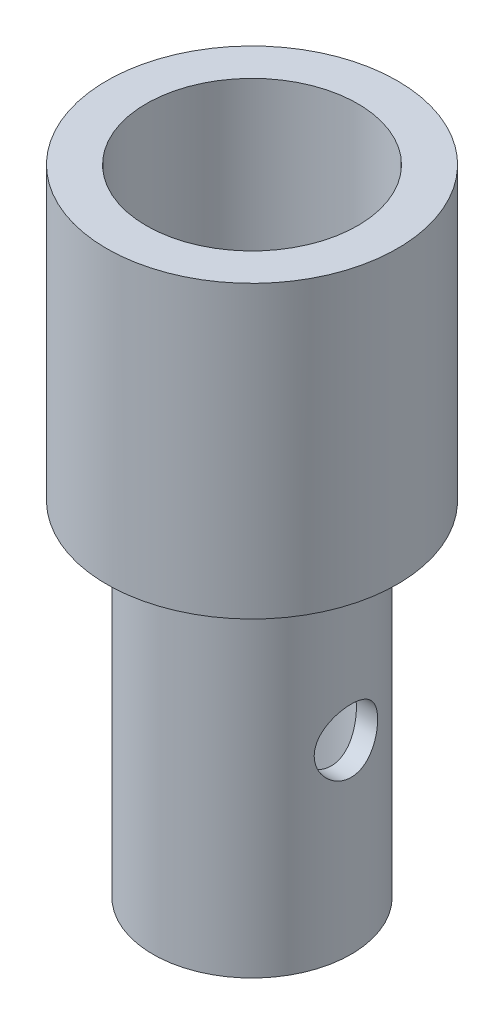
ISO-10303-21;
HEADER;
FILE_DESCRIPTION(('STEP AP214'),'2;1');
FILE_NAME('part.step','',(''),(''),'','','');
FILE_SCHEMA(('AUTOMOTIVE_DESIGN { 1 0 10303 214 1 1 1 1 }'));
ENDSEC;
DATA;
#1=APPLICATION_CONTEXT('core data for automotive mechanical design processes');
#2=APPLICATION_PROTOCOL_DEFINITION('international standard','automotive_design',2000,#1);
#3=PRODUCT_CONTEXT('',#1,'mechanical');
#4=PRODUCT('Part','Part','',(#3));
#5=PRODUCT_RELATED_PRODUCT_CATEGORY('part','',(#4));
#6=PRODUCT_DEFINITION_FORMATION('','',#4);
#7=PRODUCT_DEFINITION_CONTEXT('part definition',#1,'design');
#8=PRODUCT_DEFINITION('design','',#6,#7);
#9=PRODUCT_DEFINITION_SHAPE('','',#8);
#10=(LENGTH_UNIT() NAMED_UNIT(*) SI_UNIT(.MILLI.,.METRE.));
#11=(NAMED_UNIT(*) PLANE_ANGLE_UNIT() SI_UNIT($,.RADIAN.));
#12=(NAMED_UNIT(*) SI_UNIT($,.STERADIAN.) SOLID_ANGLE_UNIT());
#13=UNCERTAINTY_MEASURE_WITH_UNIT(LENGTH_MEASURE(1.E-05),#10,'distance_accuracy_value','');
#14=(GEOMETRIC_REPRESENTATION_CONTEXT(3) GLOBAL_UNCERTAINTY_ASSIGNED_CONTEXT((#13)) GLOBAL_UNIT_ASSIGNED_CONTEXT((#10,
#11,#12)) REPRESENTATION_CONTEXT('',''));
#15=CARTESIAN_POINT('',(0.,0.,0.));
#16=DIRECTION('',(0.,0.,1.));
#17=DIRECTION('',(1.,0.,0.));
#18=AXIS2_PLACEMENT_3D('',#15,#16,#17);
#19=CARTESIAN_POINT('',(0.,-47.625,0.));
#20=DIRECTION('',(0.,1.,0.));
#21=DIRECTION('',(0.,0.,1.));
#22=AXIS2_PLACEMENT_3D('',#19,#20,#21);
#23=CYLINDRICAL_SURFACE('',#22,9.525);
#24=CARTESIAN_POINT('',(8.72980669889088,-25.4,3.81));
#25=CARTESIAN_POINT('',(8.72980747738187,-25.5020865656871,3.80999921891842));
#26=CARTESIAN_POINT('',(8.7316035302612,-25.6042044364545,3.80589117768837));
#27=CARTESIAN_POINT('',(8.73872925778658,-25.8077005696976,3.7895003379036));
#28=CARTESIAN_POINT('',(8.7440610952037,-25.9090783410729,3.7772125359297));
#29=CARTESIAN_POINT('',(8.75809537381811,-26.1105039955711,3.74455713217612));
#30=CARTESIAN_POINT('',(8.76680453120531,-26.2105488153184,3.72417342879634));
#31=CARTESIAN_POINT('',(8.78730252503843,-26.4083999363233,3.67554450191171));
#32=CARTESIAN_POINT('',(8.79909263998481,-26.5062052899044,3.64729601444972));
#33=CARTESIAN_POINT('',(8.83844020491973,-26.7944502146137,3.55139604474048));
#34=CARTESIAN_POINT('',(8.87004966709332,-26.9807098697185,3.47242664764833));
#35=CARTESIAN_POINT('',(8.94044610819544,-27.337195708411,3.28691801772329));
#36=CARTESIAN_POINT('',(8.97923151940491,-27.5074253818114,3.18038480469522));
#37=CARTESIAN_POINT('',(9.06210097781532,-27.8369825024553,2.93622055267926));
#38=CARTESIAN_POINT('',(9.10635550256901,-27.9952866877078,2.79726326441719));
#39=CARTESIAN_POINT('',(9.19376744003837,-28.2870850386599,2.49499525834792));
#40=CARTESIAN_POINT('',(9.23692446483326,-28.4205705343691,2.33167606589396));
#41=CARTESIAN_POINT('',(9.31932488247285,-28.6640385346198,1.97740218795191));
#42=CARTESIAN_POINT('',(9.35834684996793,-28.7728867200209,1.7856117240819));
#43=CARTESIAN_POINT('',(9.42601483158086,-28.9563371719923,1.38460219550477));
#44=CARTESIAN_POINT('',(9.45466506684765,-29.0309533738102,1.17539026382774));
#45=CARTESIAN_POINT('',(9.49715508886746,-29.1401654882751,0.756221054229137));
#46=CARTESIAN_POINT('',(9.51164474489124,-29.1765240217381,0.54679021902106));
#47=CARTESIAN_POINT('',(9.52652991918456,-29.2138642767845,0.124332353087549));
#48=CARTESIAN_POINT('',(9.52693069423268,-29.2148591930799,-0.0886933066711242));
#49=CARTESIAN_POINT('',(9.5139883915877,-29.1824103207245,-0.499552901702397));
#50=CARTESIAN_POINT('',(9.50141603845793,-29.150897807152,-0.697568047529192));
#51=CARTESIAN_POINT('',(9.464979002526,-29.0576135713932,-1.08522727325679));
#52=CARTESIAN_POINT('',(9.44111349115204,-28.9958396289334,-1.27487073781632));
#53=CARTESIAN_POINT('',(9.3839695059041,-28.8430274999114,-1.64382057281083));
#54=CARTESIAN_POINT('',(9.3505545868787,-28.7515622932215,-1.82292807252289));
#55=CARTESIAN_POINT('',(9.27762784768709,-28.5423641618742,-2.16371452717611));
#56=CARTESIAN_POINT('',(9.23811393928998,-28.4246222341594,-2.32538748038156));
#57=CARTESIAN_POINT('',(9.15393718820429,-28.1572033960107,-2.6379846173172));
#58=CARTESIAN_POINT('',(9.10910662004878,-28.0059373346445,-2.78750619523124));
#59=CARTESIAN_POINT('',(9.02134964154089,-27.6803029606644,-3.0596346263241));
#60=CARTESIAN_POINT('',(8.97842385810392,-27.5059271161886,-3.1822326699145));
#61=CARTESIAN_POINT('',(8.89819589564183,-27.1327517623764,-3.4002424795099));
#62=CARTESIAN_POINT('',(8.86108681279932,-26.9334014982045,-3.494788511367));
#63=CARTESIAN_POINT('',(8.79895859605483,-26.5197294909555,-3.64841077504569));
#64=CARTESIAN_POINT('',(8.77393161182948,-26.3054175730959,-3.70751004441008));
#65=CARTESIAN_POINT('',(8.74070692233674,-25.8818968439245,-3.78514917756856));
#66=CARTESIAN_POINT('',(8.73157448098943,-25.6731761482201,-3.8059463444317));
#67=CARTESIAN_POINT('',(8.72850993440519,-25.2550729192181,-3.8129743268737));
#68=CARTESIAN_POINT('',(8.7345732196749,-25.0456906058599,-3.7992156246764));
#69=CARTESIAN_POINT('',(8.76025764504111,-24.6447457289071,-3.739577664575));
#70=CARTESIAN_POINT('',(8.77908692105765,-24.452847454253,-3.69557248315545));
#71=CARTESIAN_POINT('',(8.82719947207082,-24.0792855888836,-3.57912197606522));
#72=CARTESIAN_POINT('',(8.85648506490779,-23.8976242777304,-3.50667034434587));
#73=CARTESIAN_POINT('',(8.92366354443494,-23.5414775083997,-3.33210339321236));
#74=CARTESIAN_POINT('',(8.96185732337635,-23.3675818105387,-3.22890426404401));
#75=CARTESIAN_POINT('',(9.04208983725597,-23.038784908922,-2.99687975256181));
#76=CARTESIAN_POINT('',(9.08413013426956,-22.8838914823181,-2.86804393398354));
#77=CARTESIAN_POINT('',(9.17106844925558,-22.5856036566253,-2.57716822325093));
#78=CARTESIAN_POINT('',(9.21594817878408,-22.4439037431468,-2.41337864309134));
#79=CARTESIAN_POINT('',(9.3005870865111,-22.1897376690311,-2.06327432156922));
#80=CARTESIAN_POINT('',(9.3403460562478,-22.0772726983342,-1.87695866378718));
#81=CARTESIAN_POINT('',(9.41038978790385,-21.8851842716895,-1.48643327426745));
#82=CARTESIAN_POINT('',(9.44067681788991,-21.8055529522303,-1.28222784127166));
#83=CARTESIAN_POINT('',(9.48828519157729,-21.6822994357976,-0.86180979072314));
#84=CARTESIAN_POINT('',(9.50561357138139,-21.6386576963915,-0.645603757692743));
#85=CARTESIAN_POINT('',(9.52460010645449,-21.5909435446797,-0.222535452132903));
#86=CARTESIAN_POINT('',(9.52720688064992,-21.5844752598969,-0.015983888111822));
#87=CARTESIAN_POINT('',(9.51901910715213,-21.6049646834187,0.395161456793927));
#88=CARTESIAN_POINT('',(9.5082265880737,-21.6319173318887,0.599755529312005));
#89=CARTESIAN_POINT('',(9.47492733016673,-21.7167716484877,0.994735569210881));
#90=CARTESIAN_POINT('',(9.45279060820881,-21.7736972035711,1.18536492654433));
#91=CARTESIAN_POINT('',(9.3991737540751,-21.9158555313818,1.55433208212594));
#92=CARTESIAN_POINT('',(9.3676918987177,-22.0010935250833,1.73266760599178));
#93=CARTESIAN_POINT('',(9.29674470583298,-22.2017018318089,2.08064680910122));
#94=CARTESIAN_POINT('',(9.25698805283236,-22.3182372507516,2.24955814157398));
#95=CARTESIAN_POINT('',(9.17427809917919,-22.5763862196634,2.56613786960793));
#96=CARTESIAN_POINT('',(9.13132347972609,-22.7180101493972,2.71379742675579));
#97=CARTESIAN_POINT('',(9.04375452093767,-23.0326891125197,2.99313862724399));
#98=CARTESIAN_POINT('',(8.99920205160159,-23.2071471645137,3.12326526431714));
#99=CARTESIAN_POINT('',(8.91634576107669,-23.5767909094884,3.35250855878603));
#100=CARTESIAN_POINT('',(8.87804267480121,-23.7719790358296,3.45162157030556));
#101=CARTESIAN_POINT('',(8.81555800361856,-24.15996305645,3.60805586195513));
#102=CARTESIAN_POINT('',(8.7904172504861,-24.3514000613384,3.66833057302889));
#103=CARTESIAN_POINT('',(8.76191001465829,-24.6443236092007,3.73565387079997));
#104=CARTESIAN_POINT('',(8.75394430278663,-24.7428445666894,3.75424114668035));
#105=CARTESIAN_POINT('',(8.74129443325385,-24.9412349754544,3.78360480272399));
#106=CARTESIAN_POINT('',(8.73660837091746,-25.0411036096496,3.79438571660285));
#107=CARTESIAN_POINT('',(8.73236450840805,-25.1843069382632,3.80413481078377));
#108=CARTESIAN_POINT('',(8.73140614474182,-25.2274068383819,3.80633343140281));
#109=CARTESIAN_POINT('',(8.730127052012,-25.3136692902144,3.80926624483991));
#110=CARTESIAN_POINT('',(8.72980636969948,-25.3568318462897,3.81000033028684));
#111=CARTESIAN_POINT('',(8.72980669889088,-25.4,3.81));
#112=B_SPLINE_CURVE_WITH_KNOTS('',3,(#24,#25,#26,#27,#28,#29,#30,#31,#32,#33,#34,#35,#36,#37,
#38,#39,#40,#41,#42,#43,#44,#45,#46,#47,#48,#49,#50,#51,#52,#53,#54,#55,#56,#57,#58,#59,#60,#61,
#62,#63,#64,#65,#66,#67,#68,#69,#70,#71,#72,#73,#74,#75,#76,#77,#78,#79,#80,#81,#82,#83,#84,#85,
#86,#87,#88,#89,#90,#91,#92,#93,#94,#95,#96,#97,#98,#99,#100,#101,#102,#103,#104,#105,#106,#107,
#108,#109,#110,#111),.UNSPECIFIED.,.T.,.F.,(4,2,2,2,2,2,2,2,2,2,2,2,2,2,2,2,2,2,2,2,2,2,2,2,2,2,
2,2,2,2,2,2,2,2,2,2,2,2,2,2,2,2,2,4),(0.,0.306215494379835,0.612618467843413,0.919633909654753,
1.22677695609031,1.83807904972284,2.44924775044349,3.09211265966723,3.73520172268485,
4.40364897754064,5.07182387711753,5.70765031534978,6.34323951442198,6.94312781536619,
7.54306013655752,8.15203425082374,8.76121733595653,9.41039617109876,10.0597871071207,
10.7275210699127,11.3948205877909,12.0213530416891,12.6476954653452,13.2383642073709,
13.8291639636626,14.4439226274829,15.0589320630664,15.7193692687539,16.3798333517938,
17.040139164658,17.7000861932752,18.3169759386998,18.933772300164,19.5316221254948,
20.1295822589835,20.7539664555645,21.378609581897,22.0419217564399,22.7053118788615,
23.3091355199523,23.6105627780589,23.9118148349693,24.0412911125356,24.1707768821949),.UNSPECIFIED.);
#113=CARTESIAN_POINT('',(8.72980669889088,-25.4,3.81));
#114=VERTEX_POINT('',#113);
#115=EDGE_CURVE('E61',#114,#114,#112,.T.);
#116=ORIENTED_EDGE('',*,*,#115,.T.);
#117=EDGE_LOOP('',(#116));
#118=FACE_BOUND('',#117,.T.);
#119=CARTESIAN_POINT('',(0.,-47.625,0.));
#120=DIRECTION('',(0.,-1.,0.));
#121=DIRECTION('',(0.,0.,-1.));
#122=AXIS2_PLACEMENT_3D('',#119,#120,#121);
#123=CIRCLE('',#122,9.525);
#124=CARTESIAN_POINT('',(0.,-47.625,-9.525));
#125=VERTEX_POINT('',#124);
#126=EDGE_CURVE('E60',#125,#125,#123,.T.);
#127=ORIENTED_EDGE('',*,*,#126,.T.);
#128=EDGE_LOOP('',(#127));
#129=FACE_BOUND('',#128,.T.);
#130=CARTESIAN_POINT('',(0.,0.,0.));
#131=DIRECTION('',(0.,-1.,0.));
#132=DIRECTION('',(0.,0.,-1.));
#133=AXIS2_PLACEMENT_3D('',#130,#131,#132);
#134=CIRCLE('',#133,9.525);
#135=CARTESIAN_POINT('',(0.,0.,-9.525));
#136=VERTEX_POINT('',#135);
#137=EDGE_CURVE('E67',#136,#136,#134,.T.);
#138=ORIENTED_EDGE('',*,*,#137,.F.);
#139=EDGE_LOOP('',(#138));
#140=FACE_BOUND('',#139,.T.);
#141=CARTESIAN_POINT('',(-8.72980669889088,-25.4,3.81));
#142=CARTESIAN_POINT('',(-8.72980747738187,-25.5020865656871,3.80999921891842));
#143=CARTESIAN_POINT('',(-8.7316035302612,-25.6042044364545,3.80589117768837));
#144=CARTESIAN_POINT('',(-8.73872925778658,-25.8077005696976,3.7895003379036));
#145=CARTESIAN_POINT('',(-8.7440610952037,-25.9090783410729,3.7772125359297));
#146=CARTESIAN_POINT('',(-8.75809537381811,-26.1105039955711,3.74455713217612));
#147=CARTESIAN_POINT('',(-8.76680453120531,-26.2105488153184,3.72417342879634));
#148=CARTESIAN_POINT('',(-8.78730252503843,-26.4083999363233,3.67554450191171));
#149=CARTESIAN_POINT('',(-8.79909263998481,-26.5062052899044,3.64729601444972));
#150=CARTESIAN_POINT('',(-8.83844020491973,-26.7944502146137,3.55139604474048));
#151=CARTESIAN_POINT('',(-8.87004966709332,-26.9807098697185,3.47242664764833));
#152=CARTESIAN_POINT('',(-8.94044610819544,-27.337195708411,3.28691801772329));
#153=CARTESIAN_POINT('',(-8.97923151940491,-27.5074253818114,3.18038480469522));
#154=CARTESIAN_POINT('',(-9.06210097781532,-27.8369825024553,2.93622055267926));
#155=CARTESIAN_POINT('',(-9.10635550256901,-27.9952866877078,2.79726326441719));
#156=CARTESIAN_POINT('',(-9.19376744003837,-28.2870850386599,2.49499525834792));
#157=CARTESIAN_POINT('',(-9.23692446483326,-28.4205705343691,2.33167606589396));
#158=CARTESIAN_POINT('',(-9.31932488247285,-28.6640385346198,1.97740218795191));
#159=CARTESIAN_POINT('',(-9.35834684996793,-28.7728867200209,1.7856117240819));
#160=CARTESIAN_POINT('',(-9.42601483158086,-28.9563371719923,1.38460219550477));
#161=CARTESIAN_POINT('',(-9.45466506684765,-29.0309533738102,1.17539026382774));
#162=CARTESIAN_POINT('',(-9.49715508886746,-29.1401654882751,0.756221054229137));
#163=CARTESIAN_POINT('',(-9.51164474489124,-29.1765240217381,0.54679021902106));
#164=CARTESIAN_POINT('',(-9.52652991918456,-29.2138642767845,0.124332353087549));
#165=CARTESIAN_POINT('',(-9.52693069423268,-29.2148591930799,-0.0886933066711242));
#166=CARTESIAN_POINT('',(-9.5139883915877,-29.1824103207245,-0.499552901702397));
#167=CARTESIAN_POINT('',(-9.50141603845793,-29.150897807152,-0.697568047529192));
#168=CARTESIAN_POINT('',(-9.464979002526,-29.0576135713932,-1.08522727325679));
#169=CARTESIAN_POINT('',(-9.44111349115204,-28.9958396289334,-1.27487073781632));
#170=CARTESIAN_POINT('',(-9.3839695059041,-28.8430274999114,-1.64382057281083));
#171=CARTESIAN_POINT('',(-9.3505545868787,-28.7515622932215,-1.82292807252289));
#172=CARTESIAN_POINT('',(-9.27762784768709,-28.5423641618742,-2.16371452717611));
#173=CARTESIAN_POINT('',(-9.23811393928998,-28.4246222341594,-2.32538748038156));
#174=CARTESIAN_POINT('',(-9.15393718820429,-28.1572033960107,-2.6379846173172));
#175=CARTESIAN_POINT('',(-9.10910662004878,-28.0059373346445,-2.78750619523124));
#176=CARTESIAN_POINT('',(-9.02134964154089,-27.6803029606644,-3.0596346263241));
#177=CARTESIAN_POINT('',(-8.97842385810392,-27.5059271161886,-3.1822326699145));
#178=CARTESIAN_POINT('',(-8.89819589564183,-27.1327517623764,-3.4002424795099));
#179=CARTESIAN_POINT('',(-8.86108681279932,-26.9334014982045,-3.494788511367));
#180=CARTESIAN_POINT('',(-8.79895859605483,-26.5197294909555,-3.64841077504569));
#181=CARTESIAN_POINT('',(-8.77393161182948,-26.3054175730959,-3.70751004441008));
#182=CARTESIAN_POINT('',(-8.74070692233674,-25.8818968439245,-3.78514917756856));
#183=CARTESIAN_POINT('',(-8.73157448098943,-25.6731761482201,-3.8059463444317));
#184=CARTESIAN_POINT('',(-8.72850993440519,-25.2550729192181,-3.8129743268737));
#185=CARTESIAN_POINT('',(-8.7345732196749,-25.0456906058599,-3.7992156246764));
#186=CARTESIAN_POINT('',(-8.76025764504111,-24.6447457289071,-3.739577664575));
#187=CARTESIAN_POINT('',(-8.77908692105765,-24.452847454253,-3.69557248315545));
#188=CARTESIAN_POINT('',(-8.82719947207082,-24.0792855888836,-3.57912197606522));
#189=CARTESIAN_POINT('',(-8.85648506490779,-23.8976242777304,-3.50667034434587));
#190=CARTESIAN_POINT('',(-8.92366354443494,-23.5414775083997,-3.33210339321236));
#191=CARTESIAN_POINT('',(-8.96185732337635,-23.3675818105387,-3.22890426404401));
#192=CARTESIAN_POINT('',(-9.04208983725597,-23.038784908922,-2.99687975256181));
#193=CARTESIAN_POINT('',(-9.08413013426956,-22.8838914823181,-2.86804393398354));
#194=CARTESIAN_POINT('',(-9.17106844925558,-22.5856036566253,-2.57716822325093));
#195=CARTESIAN_POINT('',(-9.21594817878408,-22.4439037431468,-2.41337864309134));
#196=CARTESIAN_POINT('',(-9.3005870865111,-22.1897376690311,-2.06327432156922));
#197=CARTESIAN_POINT('',(-9.3403460562478,-22.0772726983342,-1.87695866378718));
#198=CARTESIAN_POINT('',(-9.41038978790385,-21.8851842716895,-1.48643327426745));
#199=CARTESIAN_POINT('',(-9.44067681788991,-21.8055529522303,-1.28222784127166));
#200=CARTESIAN_POINT('',(-9.48828519157729,-21.6822994357976,-0.86180979072314));
#201=CARTESIAN_POINT('',(-9.50561357138139,-21.6386576963915,-0.645603757692743));
#202=CARTESIAN_POINT('',(-9.52460010645449,-21.5909435446797,-0.222535452132903));
#203=CARTESIAN_POINT('',(-9.52720688064992,-21.5844752598969,-0.015983888111822));
#204=CARTESIAN_POINT('',(-9.51901910715213,-21.6049646834187,0.395161456793927));
#205=CARTESIAN_POINT('',(-9.5082265880737,-21.6319173318887,0.599755529312005));
#206=CARTESIAN_POINT('',(-9.47492733016673,-21.7167716484877,0.994735569210881));
#207=CARTESIAN_POINT('',(-9.45279060820881,-21.7736972035711,1.18536492654433));
#208=CARTESIAN_POINT('',(-9.3991737540751,-21.9158555313818,1.55433208212594));
#209=CARTESIAN_POINT('',(-9.3676918987177,-22.0010935250833,1.73266760599178));
#210=CARTESIAN_POINT('',(-9.29674470583298,-22.2017018318089,2.08064680910122));
#211=CARTESIAN_POINT('',(-9.25698805283236,-22.3182372507516,2.24955814157398));
#212=CARTESIAN_POINT('',(-9.17427809917919,-22.5763862196634,2.56613786960793));
#213=CARTESIAN_POINT('',(-9.13132347972609,-22.7180101493972,2.71379742675579));
#214=CARTESIAN_POINT('',(-9.04375452093767,-23.0326891125197,2.99313862724399));
#215=CARTESIAN_POINT('',(-8.99920205160159,-23.2071471645137,3.12326526431714));
#216=CARTESIAN_POINT('',(-8.91634576107669,-23.5767909094884,3.35250855878603));
#217=CARTESIAN_POINT('',(-8.87804267480121,-23.7719790358296,3.45162157030556));
#218=CARTESIAN_POINT('',(-8.81555800361856,-24.15996305645,3.60805586195513));
#219=CARTESIAN_POINT('',(-8.7904172504861,-24.3514000613384,3.66833057302889));
#220=CARTESIAN_POINT('',(-8.76191001465829,-24.6443236092007,3.73565387079997));
#221=CARTESIAN_POINT('',(-8.75394430278663,-24.7428445666894,3.75424114668035));
#222=CARTESIAN_POINT('',(-8.74129443325385,-24.9412349754544,3.78360480272399));
#223=CARTESIAN_POINT('',(-8.73660837091746,-25.0411036096496,3.79438571660285));
#224=CARTESIAN_POINT('',(-8.73236450840805,-25.1843069382632,3.80413481078377));
#225=CARTESIAN_POINT('',(-8.73140614474182,-25.2274068383819,3.80633343140281));
#226=CARTESIAN_POINT('',(-8.730127052012,-25.3136692902144,3.80926624483991));
#227=CARTESIAN_POINT('',(-8.72980636969948,-25.3568318462897,3.81000033028684));
#228=CARTESIAN_POINT('',(-8.72980669889088,-25.4,3.81));
#229=B_SPLINE_CURVE_WITH_KNOTS('',3,(#141,#142,#143,#144,#145,#146,#147,#148,#149,#150,#151,
#152,#153,#154,#155,#156,#157,#158,#159,#160,#161,#162,#163,#164,#165,#166,#167,#168,#169,#170,
#171,#172,#173,#174,#175,#176,#177,#178,#179,#180,#181,#182,#183,#184,#185,#186,#187,#188,#189,
#190,#191,#192,#193,#194,#195,#196,#197,#198,#199,#200,#201,#202,#203,#204,#205,#206,#207,#208,
#209,#210,#211,#212,#213,#214,#215,#216,#217,#218,#219,#220,#221,#222,#223,#224,#225,#226,#227,
#228),.UNSPECIFIED.,.T.,.F.,(4,2,2,2,2,2,2,2,2,2,2,2,2,2,2,2,2,2,2,2,2,2,2,2,2,2,2,2,2,2,2,2,2,
2,2,2,2,2,2,2,2,2,2,4),(0.,0.306215494379835,0.612618467843413,0.919633909654753,
1.22677695609031,1.83807904972284,2.44924775044349,3.09211265966723,3.73520172268485,
4.40364897754064,5.07182387711753,5.70765031534978,6.34323951442198,6.94312781536619,
7.54306013655752,8.15203425082374,8.76121733595653,9.41039617109876,10.0597871071207,
10.7275210699127,11.3948205877909,12.0213530416891,12.6476954653452,13.2383642073709,
13.8291639636626,14.4439226274829,15.0589320630664,15.7193692687539,16.3798333517938,
17.040139164658,17.7000861932752,18.3169759386998,18.933772300164,19.5316221254948,
20.1295822589835,20.7539664555645,21.378609581897,22.0419217564399,22.7053118788615,
23.3091355199523,23.6105627780589,23.9118148349693,24.0412911125356,24.1707768821949),.UNSPECIFIED.);
#230=CARTESIAN_POINT('',(-8.72980669889088,-25.4,3.81));
#231=VERTEX_POINT('',#230);
#232=EDGE_CURVE('E101',#231,#231,#229,.T.);
#233=ORIENTED_EDGE('',*,*,#232,.F.);
#234=EDGE_LOOP('',(#233));
#235=FACE_BOUND('',#234,.T.);
#236=ADVANCED_FACE('F37',(#118,#129,#140,#235),#23,.F.);
#237=CARTESIAN_POINT('',(0.,49.3914086658803,0.));
#238=DIRECTION('',(0.,-1.,0.));
#239=DIRECTION('',(0.,0.,-1.));
#240=AXIS2_PLACEMENT_3D('',#237,#238,#239);
#241=CYLINDRICAL_SURFACE('',#240,11.90625);
#242=CARTESIAN_POINT('',(0.,-47.625,0.));
#243=DIRECTION('',(0.,-1.,0.));
#244=DIRECTION('',(0.,0.,-1.));
#245=AXIS2_PLACEMENT_3D('',#242,#243,#244);
#246=CIRCLE('',#245,11.90625);
#247=CARTESIAN_POINT('',(0.,-47.625,-11.90625));
#248=VERTEX_POINT('',#247);
#249=EDGE_CURVE('E105',#248,#248,#246,.T.);
#250=ORIENTED_EDGE('',*,*,#249,.F.);
#251=EDGE_LOOP('',(#250));
#252=FACE_BOUND('',#251,.T.);
#253=CARTESIAN_POINT('',(0.,-6.35,0.));
#254=DIRECTION('',(0.,-1.,0.));
#255=DIRECTION('',(0.,0.,-1.));
#256=AXIS2_PLACEMENT_3D('',#253,#254,#255);
#257=CIRCLE('',#256,11.90625);
#258=CARTESIAN_POINT('',(0.,-6.35,-11.90625));
#259=VERTEX_POINT('',#258);
#260=EDGE_CURVE('E100',#259,#259,#257,.F.);
#261=ORIENTED_EDGE('',*,*,#260,.F.);
#262=EDGE_LOOP('',(#261));
#263=FACE_BOUND('',#262,.T.);
#264=CARTESIAN_POINT('',(11.2801901164165,-25.4,3.81));
#265=CARTESIAN_POINT('',(11.2801907713837,-25.6080408542117,3.80999938978375));
#266=CARTESIAN_POINT('',(11.2860084223011,-25.8160889183156,3.79290246227797));
#267=CARTESIAN_POINT('',(11.308541293333,-26.2260546430205,3.72517437841876));
#268=CARTESIAN_POINT('',(11.3252590416891,-26.4279708699878,3.67453544206372));
#269=CARTESIAN_POINT('',(11.3675088910845,-26.8196729170321,3.5416574585783));
#270=CARTESIAN_POINT('',(11.3930247994879,-27.0094802677505,3.45947643209969));
#271=CARTESIAN_POINT('',(11.449973104657,-27.3726695076837,3.26604235794547));
#272=CARTESIAN_POINT('',(11.4814066410428,-27.5460482233779,3.15478370887961));
#273=CARTESIAN_POINT('',(11.547918756211,-27.8777058534074,2.90205894900935));
#274=CARTESIAN_POINT('',(11.5830828956024,-28.0353059565367,2.75972432074192));
#275=CARTESIAN_POINT('',(11.6523677975874,-28.3248570515884,2.45074469129871));
#276=CARTESIAN_POINT('',(11.6864884063885,-28.4568042780691,2.28409612749165));
#277=CARTESIAN_POINT('',(11.75082469535,-28.6943293237456,1.92631081223947));
#278=CARTESIAN_POINT('',(11.7809279353835,-28.7992037742927,1.73468511296899));
#279=CARTESIAN_POINT('',(11.8328353634951,-28.9749672054432,1.33538641079223));
#280=CARTESIAN_POINT('',(11.8546416022912,-29.0458645850724,1.12771738849967));
#281=CARTESIAN_POINT('',(11.886892295236,-29.1493823742875,0.709337965971051));
#282=CARTESIAN_POINT('',(11.8976806192989,-29.1831639260567,0.498941857256671));
#283=CARTESIAN_POINT('',(11.9078965895931,-29.2151747074745,0.0752097093731693));
#284=CARTESIAN_POINT('',(11.9073269400682,-29.2134123998343,-0.138125617903466));
#285=CARTESIAN_POINT('',(11.8951283240496,-29.1751396859283,-0.553491777031936));
#286=CARTESIAN_POINT('',(11.8839002575346,-29.1398888613921,-0.755652340697741));
#287=CARTESIAN_POINT('',(11.8521430939953,-29.037712220907,-1.15102074925322));
#288=CARTESIAN_POINT('',(11.831613381036,-28.9707843073566,-1.34422800033985));
#289=CARTESIAN_POINT('',(11.7830313139218,-28.8063704275672,-1.71905759252031));
#290=CARTESIAN_POINT('',(11.7548875899221,-28.7085106988312,-1.90050365677326));
#291=CARTESIAN_POINT('',(11.6940302239583,-28.4853136948219,-2.24478398533579));
#292=CARTESIAN_POINT('',(11.6613153850602,-28.3599692178322,-2.40761335454388));
#293=CARTESIAN_POINT('',(11.593102984835,-28.0789356781264,-2.71754328198413));
#294=CARTESIAN_POINT('',(11.5575462859818,-27.9221619854827,-2.86364871563205));
#295=CARTESIAN_POINT('',(11.4888784054941,-27.5860154535289,-3.12780062522132));
#296=CARTESIAN_POINT('',(11.4557675422045,-27.4066396805709,-3.24584345301152));
#297=CARTESIAN_POINT('',(11.3954327596139,-27.0274492622169,-3.45175342433642));
#298=CARTESIAN_POINT('',(11.368285757162,-26.8274115581814,-3.53923402599173));
#299=CARTESIAN_POINT('',(11.3238498616603,-26.4143629549534,-3.67894699538996));
#300=CARTESIAN_POINT('',(11.3065572215543,-26.2013570209912,-3.73119276233461));
#301=CARTESIAN_POINT('',(11.2846254446411,-25.7779903140599,-3.79699583164028));
#302=CARTESIAN_POINT('',(11.2794860538154,-25.5678932499172,-3.81208377840346));
#303=CARTESIAN_POINT('',(11.2810504020167,-25.1481488307895,-3.80745367953243));
#304=CARTESIAN_POINT('',(11.2877522007183,-24.9385014077612,-3.7877413363572));
#305=CARTESIAN_POINT('',(11.3117481761892,-24.5323272036354,-3.71544088027257));
#306=CARTESIAN_POINT('',(11.3287098282462,-24.3355951881732,-3.66388379898133));
#307=CARTESIAN_POINT('',(11.3709572653769,-23.9536021758695,-3.53057727390665));
#308=CARTESIAN_POINT('',(11.3962444508822,-23.7683431151178,-3.44882275035266));
#309=CARTESIAN_POINT('',(11.4532277213546,-23.4084466889459,-3.25466769701989));
#310=CARTESIAN_POINT('',(11.4850922283964,-23.2342898943353,-3.14142708063189));
#311=CARTESIAN_POINT('',(11.5512989541129,-22.9068945384249,-2.88848481941069));
#312=CARTESIAN_POINT('',(11.5856418457873,-22.7536616918927,-2.74877597032476));
#313=CARTESIAN_POINT('',(11.6547545794491,-22.4655401178023,-2.43959295397962));
#314=CARTESIAN_POINT('',(11.6894773093447,-22.3317479412288,-2.26908357973566));
#315=CARTESIAN_POINT('',(11.7539420479145,-22.0946224097348,-1.90718809463543));
#316=CARTESIAN_POINT('',(11.7836842692113,-21.9912877544107,-1.71580287556508));
#317=CARTESIAN_POINT('',(11.8346765106693,-21.8189905315063,-1.31869758065327));
#318=CARTESIAN_POINT('',(11.8559860068543,-21.7497863555272,-1.11309037023182));
#319=CARTESIAN_POINT('',(11.8879721122896,-21.6471878520863,-0.692348396602513));
#320=CARTESIAN_POINT('',(11.8986522275102,-21.6137817168028,-0.477216799366499));
#321=CARTESIAN_POINT('',(11.9079324131159,-21.5847238455637,-0.0536034499807144));
#322=CARTESIAN_POINT('',(11.9070381439575,-21.5874917935851,0.154760067577383));
#323=CARTESIAN_POINT('',(11.8944931876559,-21.6268548081282,0.567917261523853));
#324=CARTESIAN_POINT('',(11.882843260673,-21.6634474840746,0.772711189152181));
#325=CARTESIAN_POINT('',(11.8502652446312,-21.7683991322614,1.17015349279156));
#326=CARTESIAN_POINT('',(11.829466057955,-21.8363173868862,1.36292955578984));
#327=CARTESIAN_POINT('',(11.7807325020907,-22.001590989044,1.7344371039793));
#328=CARTESIAN_POINT('',(11.7527968823823,-22.0989514963062,1.91316612051519));
#329=CARTESIAN_POINT('',(11.691474446828,-22.324284887914,2.25832477115891));
#330=CARTESIAN_POINT('',(11.6579309291843,-22.4532108312118,2.42410405306973));
#331=CARTESIAN_POINT('',(11.5896005188201,-22.7363558380949,2.73219673858007));
#332=CARTESIAN_POINT('',(11.5548132479083,-22.8905826470216,2.87450292953646));
#333=CARTESIAN_POINT('',(11.4864721175774,-23.2264584499211,3.13668242972551));
#334=CARTESIAN_POINT('',(11.4530048853998,-23.4088820986826,3.25558882388913));
#335=CARTESIAN_POINT('',(11.3926374213726,-23.7921435803836,3.46094181799192));
#336=CARTESIAN_POINT('',(11.3657348566329,-23.9929748367955,3.54739995498383));
#337=CARTESIAN_POINT('',(11.3234597386517,-24.3926903903892,3.68002200207636));
#338=CARTESIAN_POINT('',(11.3074031009805,-24.5906968399529,3.72861485333093));
#339=CARTESIAN_POINT('',(11.2857694278991,-24.9924676334378,3.79359966863491));
#340=CARTESIAN_POINT('',(11.2801894748962,-25.196230358277,3.81000059768812));
#341=CARTESIAN_POINT('',(11.2801901164165,-25.4,3.81));
#342=B_SPLINE_CURVE_WITH_KNOTS('',3,(#264,#265,#266,#267,#268,#269,#270,#271,#272,#273,#274,
#275,#276,#277,#278,#279,#280,#281,#282,#283,#284,#285,#286,#287,#288,#289,#290,#291,#292,#293,
#294,#295,#296,#297,#298,#299,#300,#301,#302,#303,#304,#305,#306,#307,#308,#309,#310,#311,#312,
#313,#314,#315,#316,#317,#318,#319,#320,#321,#322,#323,#324,#325,#326,#327,#328,#329,#330,#331,
#332,#333,#334,#335,#336,#337,#338,#339,#340,#341),.UNSPECIFIED.,.T.,.F.,(4,2,2,2,2,2,2,2,2,2,2,
2,2,2,2,2,2,2,2,2,2,2,2,2,2,2,2,2,2,2,2,2,2,2,2,2,2,2,4),(0.,0.623369190186373,1.24688302026028,
1.86925537151177,2.49174770242344,3.13458742247901,3.77752143024192,4.43577767650616,
5.09387111984355,5.73073230961601,6.36744186957859,6.98111365877959,7.59482608994043,
8.21625761993108,8.83785217608153,9.48654443947136,10.135320987083,10.7920288783218,
11.4484868938099,12.0774140436849,12.7062381456137,13.3156989292734,13.9252622822806,
14.5529773065997,15.1808634315632,15.8362333863335,16.491575355602,17.1422091009296,
17.7926281715409,18.414731382858,19.0367906301587,19.6503532700258,20.264023498587,
20.8991952008699,21.5345617120451,22.1923118116296,22.8498278245925,23.4605689516109,
24.071139971552),.UNSPECIFIED.);
#343=CARTESIAN_POINT('',(11.2801901164165,-25.4,3.81));
#344=VERTEX_POINT('',#343);
#345=EDGE_CURVE('E41',#344,#344,#342,.T.);
#346=ORIENTED_EDGE('',*,*,#345,.F.);
#347=EDGE_LOOP('',(#346));
#348=FACE_BOUND('',#347,.T.);
#349=CARTESIAN_POINT('',(-11.2801901164165,-25.4,3.81));
#350=CARTESIAN_POINT('',(-11.2801907713837,-25.6080408542117,3.80999938978375));
#351=CARTESIAN_POINT('',(-11.2860084223011,-25.8160889183156,3.79290246227797));
#352=CARTESIAN_POINT('',(-11.308541293333,-26.2260546430205,3.72517437841876));
#353=CARTESIAN_POINT('',(-11.3252590416891,-26.4279708699878,3.67453544206372));
#354=CARTESIAN_POINT('',(-11.3675088910845,-26.8196729170321,3.5416574585783));
#355=CARTESIAN_POINT('',(-11.3930247994879,-27.0094802677505,3.45947643209969));
#356=CARTESIAN_POINT('',(-11.449973104657,-27.3726695076837,3.26604235794547));
#357=CARTESIAN_POINT('',(-11.4814066410428,-27.5460482233779,3.15478370887961));
#358=CARTESIAN_POINT('',(-11.547918756211,-27.8777058534074,2.90205894900935));
#359=CARTESIAN_POINT('',(-11.5830828956024,-28.0353059565367,2.75972432074192));
#360=CARTESIAN_POINT('',(-11.6523677975874,-28.3248570515884,2.45074469129871));
#361=CARTESIAN_POINT('',(-11.6864884063885,-28.4568042780691,2.28409612749165));
#362=CARTESIAN_POINT('',(-11.75082469535,-28.6943293237456,1.92631081223947));
#363=CARTESIAN_POINT('',(-11.7809279353835,-28.7992037742927,1.73468511296899));
#364=CARTESIAN_POINT('',(-11.8328353634951,-28.9749672054432,1.33538641079223));
#365=CARTESIAN_POINT('',(-11.8546416022912,-29.0458645850724,1.12771738849967));
#366=CARTESIAN_POINT('',(-11.886892295236,-29.1493823742875,0.709337965971051));
#367=CARTESIAN_POINT('',(-11.8976806192989,-29.1831639260567,0.498941857256671));
#368=CARTESIAN_POINT('',(-11.9078965895931,-29.2151747074745,0.0752097093731693));
#369=CARTESIAN_POINT('',(-11.9073269400682,-29.2134123998343,-0.138125617903466));
#370=CARTESIAN_POINT('',(-11.8951283240496,-29.1751396859283,-0.553491777031936));
#371=CARTESIAN_POINT('',(-11.8839002575346,-29.1398888613921,-0.755652340697741));
#372=CARTESIAN_POINT('',(-11.8521430939953,-29.037712220907,-1.15102074925322));
#373=CARTESIAN_POINT('',(-11.831613381036,-28.9707843073566,-1.34422800033985));
#374=CARTESIAN_POINT('',(-11.7830313139218,-28.8063704275672,-1.71905759252031));
#375=CARTESIAN_POINT('',(-11.7548875899221,-28.7085106988312,-1.90050365677326));
#376=CARTESIAN_POINT('',(-11.6940302239583,-28.4853136948219,-2.24478398533579));
#377=CARTESIAN_POINT('',(-11.6613153850602,-28.3599692178322,-2.40761335454388));
#378=CARTESIAN_POINT('',(-11.593102984835,-28.0789356781264,-2.71754328198413));
#379=CARTESIAN_POINT('',(-11.5575462859818,-27.9221619854827,-2.86364871563205));
#380=CARTESIAN_POINT('',(-11.4888784054941,-27.5860154535289,-3.12780062522132));
#381=CARTESIAN_POINT('',(-11.4557675422045,-27.4066396805709,-3.24584345301152));
#382=CARTESIAN_POINT('',(-11.3954327596139,-27.0274492622169,-3.45175342433642));
#383=CARTESIAN_POINT('',(-11.368285757162,-26.8274115581814,-3.53923402599173));
#384=CARTESIAN_POINT('',(-11.3238498616603,-26.4143629549534,-3.67894699538996));
#385=CARTESIAN_POINT('',(-11.3065572215543,-26.2013570209912,-3.73119276233461));
#386=CARTESIAN_POINT('',(-11.2846254446411,-25.7779903140599,-3.79699583164028));
#387=CARTESIAN_POINT('',(-11.2794860538154,-25.5678932499172,-3.81208377840346));
#388=CARTESIAN_POINT('',(-11.2810504020167,-25.1481488307895,-3.80745367953243));
#389=CARTESIAN_POINT('',(-11.2877522007183,-24.9385014077612,-3.7877413363572));
#390=CARTESIAN_POINT('',(-11.3117481761892,-24.5323272036354,-3.71544088027257));
#391=CARTESIAN_POINT('',(-11.3287098282462,-24.3355951881732,-3.66388379898133));
#392=CARTESIAN_POINT('',(-11.3709572653769,-23.9536021758695,-3.53057727390665));
#393=CARTESIAN_POINT('',(-11.3962444508822,-23.7683431151178,-3.44882275035266));
#394=CARTESIAN_POINT('',(-11.4532277213546,-23.4084466889459,-3.25466769701989));
#395=CARTESIAN_POINT('',(-11.4850922283964,-23.2342898943353,-3.14142708063189));
#396=CARTESIAN_POINT('',(-11.5512989541129,-22.9068945384249,-2.88848481941069));
#397=CARTESIAN_POINT('',(-11.5856418457873,-22.7536616918927,-2.74877597032476));
#398=CARTESIAN_POINT('',(-11.6547545794491,-22.4655401178023,-2.43959295397962));
#399=CARTESIAN_POINT('',(-11.6894773093447,-22.3317479412288,-2.26908357973566));
#400=CARTESIAN_POINT('',(-11.7539420479145,-22.0946224097348,-1.90718809463543));
#401=CARTESIAN_POINT('',(-11.7836842692113,-21.9912877544107,-1.71580287556508));
#402=CARTESIAN_POINT('',(-11.8346765106693,-21.8189905315063,-1.31869758065327));
#403=CARTESIAN_POINT('',(-11.8559860068543,-21.7497863555272,-1.11309037023182));
#404=CARTESIAN_POINT('',(-11.8879721122896,-21.6471878520863,-0.692348396602513));
#405=CARTESIAN_POINT('',(-11.8986522275102,-21.6137817168028,-0.477216799366499));
#406=CARTESIAN_POINT('',(-11.9079324131159,-21.5847238455637,-0.0536034499807144));
#407=CARTESIAN_POINT('',(-11.9070381439575,-21.5874917935851,0.154760067577383));
#408=CARTESIAN_POINT('',(-11.8944931876559,-21.6268548081282,0.567917261523853));
#409=CARTESIAN_POINT('',(-11.882843260673,-21.6634474840746,0.772711189152181));
#410=CARTESIAN_POINT('',(-11.8502652446312,-21.7683991322614,1.17015349279156));
#411=CARTESIAN_POINT('',(-11.829466057955,-21.8363173868862,1.36292955578984));
#412=CARTESIAN_POINT('',(-11.7807325020907,-22.001590989044,1.7344371039793));
#413=CARTESIAN_POINT('',(-11.7527968823823,-22.0989514963062,1.91316612051519));
#414=CARTESIAN_POINT('',(-11.691474446828,-22.324284887914,2.25832477115891));
#415=CARTESIAN_POINT('',(-11.6579309291843,-22.4532108312118,2.42410405306973));
#416=CARTESIAN_POINT('',(-11.5896005188201,-22.7363558380949,2.73219673858007));
#417=CARTESIAN_POINT('',(-11.5548132479083,-22.8905826470216,2.87450292953646));
#418=CARTESIAN_POINT('',(-11.4864721175774,-23.2264584499211,3.13668242972551));
#419=CARTESIAN_POINT('',(-11.4530048853998,-23.4088820986826,3.25558882388913));
#420=CARTESIAN_POINT('',(-11.3926374213726,-23.7921435803836,3.46094181799192));
#421=CARTESIAN_POINT('',(-11.3657348566329,-23.9929748367955,3.54739995498383));
#422=CARTESIAN_POINT('',(-11.3234597386517,-24.3926903903892,3.68002200207636));
#423=CARTESIAN_POINT('',(-11.3074031009805,-24.5906968399529,3.72861485333093));
#424=CARTESIAN_POINT('',(-11.2857694278991,-24.9924676334378,3.79359966863491));
#425=CARTESIAN_POINT('',(-11.2801894748962,-25.196230358277,3.81000059768812));
#426=CARTESIAN_POINT('',(-11.2801901164165,-25.4,3.81));
#427=B_SPLINE_CURVE_WITH_KNOTS('',3,(#349,#350,#351,#352,#353,#354,#355,#356,#357,#358,#359,
#360,#361,#362,#363,#364,#365,#366,#367,#368,#369,#370,#371,#372,#373,#374,#375,#376,#377,#378,
#379,#380,#381,#382,#383,#384,#385,#386,#387,#388,#389,#390,#391,#392,#393,#394,#395,#396,#397,
#398,#399,#400,#401,#402,#403,#404,#405,#406,#407,#408,#409,#410,#411,#412,#413,#414,#415,#416,
#417,#418,#419,#420,#421,#422,#423,#424,#425,#426),.UNSPECIFIED.,.T.,.F.,(4,2,2,2,2,2,2,2,2,2,2,
2,2,2,2,2,2,2,2,2,2,2,2,2,2,2,2,2,2,2,2,2,2,2,2,2,2,2,4),(0.,0.623369190186373,1.24688302026028,
1.86925537151177,2.49174770242344,3.13458742247901,3.77752143024192,4.43577767650616,
5.09387111984355,5.73073230961601,6.36744186957859,6.98111365877959,7.59482608994043,
8.21625761993108,8.83785217608153,9.48654443947136,10.135320987083,10.7920288783218,
11.4484868938099,12.0774140436849,12.7062381456137,13.3156989292734,13.9252622822806,
14.5529773065997,15.1808634315632,15.8362333863335,16.491575355602,17.1422091009296,
17.7926281715409,18.414731382858,19.0367906301587,19.6503532700258,20.264023498587,
20.8991952008699,21.5345617120451,22.1923118116296,22.8498278245925,23.4605689516109,
24.071139971552),.UNSPECIFIED.);
#428=CARTESIAN_POINT('',(-11.2801901164165,-25.4,3.81));
#429=VERTEX_POINT('',#428);
#430=EDGE_CURVE('E93',#429,#429,#427,.T.);
#431=ORIENTED_EDGE('',*,*,#430,.T.);
#432=EDGE_LOOP('',(#431));
#433=FACE_BOUND('',#432,.T.);
#434=ADVANCED_FACE('F82',(#252,#263,#348,#433),#241,.T.);
#435=CARTESIAN_POINT('',(0.,28.575,0.));
#436=DIRECTION('',(0.,-1.,0.));
#437=DIRECTION('',(0.,0.,-1.));
#438=AXIS2_PLACEMENT_3D('',#435,#436,#437);
#439=CYLINDRICAL_SURFACE('',#438,17.4625);
#440=CARTESIAN_POINT('',(0.,28.575,0.));
#441=DIRECTION('',(0.,1.,0.));
#442=DIRECTION('',(0.,0.,1.));
#443=AXIS2_PLACEMENT_3D('',#440,#441,#442);
#444=CIRCLE('',#443,17.4625);
#445=CARTESIAN_POINT('',(0.,28.575,17.4625));
#446=VERTEX_POINT('',#445);
#447=EDGE_CURVE('E11',#446,#446,#444,.T.);
#448=ORIENTED_EDGE('',*,*,#447,.F.);
#449=EDGE_LOOP('',(#448));
#450=FACE_BOUND('',#449,.T.);
#451=CARTESIAN_POINT('',(0.,-6.35,0.));
#452=DIRECTION('',(0.,-1.,0.));
#453=DIRECTION('',(0.,0.,-1.));
#454=AXIS2_PLACEMENT_3D('',#451,#452,#453);
#455=CIRCLE('',#454,17.4625);
#456=CARTESIAN_POINT('',(0.,-6.35,-17.4625));
#457=VERTEX_POINT('',#456);
#458=EDGE_CURVE('E131',#457,#457,#455,.F.);
#459=ORIENTED_EDGE('',*,*,#458,.T.);
#460=EDGE_LOOP('',(#459));
#461=FACE_BOUND('',#460,.T.);
#462=ADVANCED_FACE('F86',(#450,#461),#439,.T.);
#463=CARTESIAN_POINT('',(0.,-47.625,0.));
#464=DIRECTION('',(0.,-1.,0.));
#465=DIRECTION('',(0.,0.,-1.));
#466=AXIS2_PLACEMENT_3D('',#463,#464,#465);
#467=PLANE('',#466);
#468=ORIENTED_EDGE('',*,*,#126,.F.);
#469=EDGE_LOOP('',(#468));
#470=FACE_BOUND('',#469,.T.);
#471=ORIENTED_EDGE('',*,*,#249,.T.);
#472=EDGE_LOOP('',(#471));
#473=FACE_BOUND('',#472,.T.);
#474=ADVANCED_FACE('F74',(#470,#473),#467,.T.);
#475=CARTESIAN_POINT('',(17.4625,-25.4,0.));
#476=DIRECTION('',(-1.,0.,0.));
#477=DIRECTION('',(0.,0.,1.));
#478=AXIS2_PLACEMENT_3D('',#475,#476,#477);
#479=CYLINDRICAL_SURFACE('',#478,3.81);
#480=ORIENTED_EDGE('',*,*,#115,.F.);
#481=EDGE_LOOP('',(#480));
#482=FACE_BOUND('',#481,.T.);
#483=ORIENTED_EDGE('',*,*,#345,.T.);
#484=EDGE_LOOP('',(#483));
#485=FACE_BOUND('',#484,.T.);
#486=ADVANCED_FACE('F70',(#482,#485),#479,.F.);
#487=CARTESIAN_POINT('',(0.,28.575,0.));
#488=DIRECTION('',(0.,-1.,0.));
#489=DIRECTION('',(0.,0.,-1.));
#490=AXIS2_PLACEMENT_3D('',#487,#488,#489);
#491=CYLINDRICAL_SURFACE('',#490,12.7);
#492=CARTESIAN_POINT('',(0.,28.575,0.));
#493=DIRECTION('',(0.,1.,0.));
#494=DIRECTION('',(0.,0.,1.));
#495=AXIS2_PLACEMENT_3D('',#492,#493,#494);
#496=CIRCLE('',#495,12.7);
#497=CARTESIAN_POINT('',(0.,28.575,12.7));
#498=VERTEX_POINT('',#497);
#499=EDGE_CURVE('E50',#498,#498,#496,.T.);
#500=ORIENTED_EDGE('',*,*,#499,.T.);
#501=EDGE_LOOP('',(#500));
#502=FACE_BOUND('',#501,.T.);
#503=CARTESIAN_POINT('',(0.,0.,0.));
#504=DIRECTION('',(0.,1.,0.));
#505=DIRECTION('',(0.,0.,1.));
#506=AXIS2_PLACEMENT_3D('',#503,#504,#505);
#507=CIRCLE('',#506,12.7);
#508=CARTESIAN_POINT('',(0.,0.,12.7));
#509=VERTEX_POINT('',#508);
#510=EDGE_CURVE('E55',#509,#509,#507,.T.);
#511=ORIENTED_EDGE('',*,*,#510,.F.);
#512=EDGE_LOOP('',(#511));
#513=FACE_BOUND('',#512,.T.);
#514=ADVANCED_FACE('F39',(#502,#513),#491,.F.);
#515=CARTESIAN_POINT('',(0.,28.575,0.));
#516=DIRECTION('',(0.,1.,0.));
#517=DIRECTION('',(0.,0.,1.));
#518=AXIS2_PLACEMENT_3D('',#515,#516,#517);
#519=PLANE('',#518);
#520=ORIENTED_EDGE('',*,*,#499,.F.);
#521=EDGE_LOOP('',(#520));
#522=FACE_BOUND('',#521,.T.);
#523=ORIENTED_EDGE('',*,*,#447,.T.);
#524=EDGE_LOOP('',(#523));
#525=FACE_BOUND('',#524,.T.);
#526=ADVANCED_FACE('F155',(#522,#525),#519,.T.);
#527=CARTESIAN_POINT('',(0.,0.,0.));
#528=DIRECTION('',(0.,-1.,0.));
#529=DIRECTION('',(0.,0.,-1.));
#530=AXIS2_PLACEMENT_3D('',#527,#528,#529);
#531=PLANE('',#530);
#532=ORIENTED_EDGE('',*,*,#137,.T.);
#533=EDGE_LOOP('',(#532));
#534=FACE_BOUND('',#533,.T.);
#535=ORIENTED_EDGE('',*,*,#510,.T.);
#536=EDGE_LOOP('',(#535));
#537=FACE_BOUND('',#536,.T.);
#538=ADVANCED_FACE('F80',(#534,#537),#531,.F.);
#539=CARTESIAN_POINT('',(0.,-6.35,0.));
#540=DIRECTION('',(0.,-1.,0.));
#541=DIRECTION('',(0.,0.,-1.));
#542=AXIS2_PLACEMENT_3D('',#539,#540,#541);
#543=PLANE('',#542);
#544=ORIENTED_EDGE('',*,*,#458,.F.);
#545=EDGE_LOOP('',(#544));
#546=FACE_BOUND('',#545,.T.);
#547=ORIENTED_EDGE('',*,*,#260,.T.);
#548=EDGE_LOOP('',(#547));
#549=FACE_BOUND('',#548,.T.);
#550=ADVANCED_FACE('F76',(#546,#549),#543,.T.);
#551=CARTESIAN_POINT('',(-17.4625,-25.4,0.));
#552=DIRECTION('',(1.,0.,0.));
#553=DIRECTION('',(0.,0.,1.));
#554=AXIS2_PLACEMENT_3D('',#551,#552,#553);
#555=CYLINDRICAL_SURFACE('',#554,3.81);
#556=ORIENTED_EDGE('',*,*,#232,.T.);
#557=EDGE_LOOP('',(#556));
#558=FACE_BOUND('',#557,.T.);
#559=ORIENTED_EDGE('',*,*,#430,.F.);
#560=EDGE_LOOP('',(#559));
#561=FACE_BOUND('',#560,.T.);
#562=ADVANCED_FACE('F79',(#558,#561),#555,.F.);
#563=CLOSED_SHELL('',(#236,#434,#462,#474,#486,#514,#526,#538,#550,#562));
#564=MANIFOLD_SOLID_BREP('B2',#563);
#565=ADVANCED_BREP_SHAPE_REPRESENTATION('',(#18,#564),#14);
#566=SHAPE_DEFINITION_REPRESENTATION(#9,#565);
ENDSEC;
END-ISO-10303-21;
